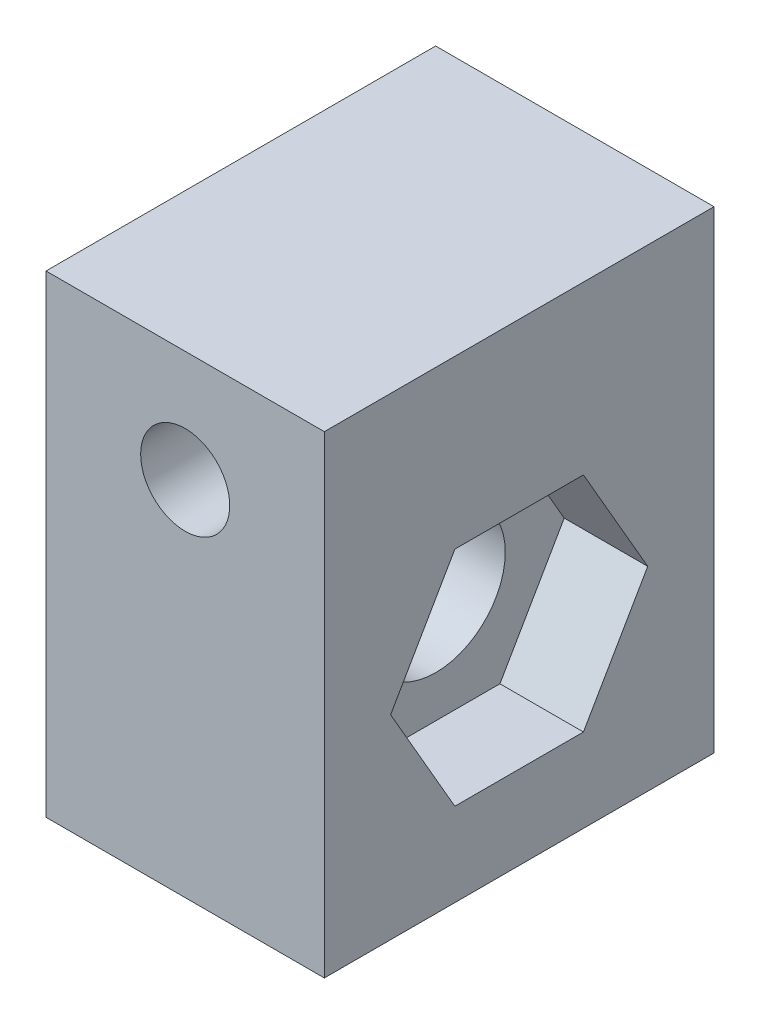
ISO-10303-21;
HEADER;
FILE_DESCRIPTION(('STEP AP214'),'2;1');
FILE_NAME('part.step','',(''),(''),'','','');
FILE_SCHEMA(('AUTOMOTIVE_DESIGN { 1 0 10303 214 1 1 1 1 }'));
ENDSEC;
DATA;
#1=APPLICATION_CONTEXT('core data for automotive mechanical design processes');
#2=APPLICATION_PROTOCOL_DEFINITION('international standard','automotive_design',2000,#1);
#3=PRODUCT_CONTEXT('',#1,'mechanical');
#4=PRODUCT('Part','Part','',(#3));
#5=PRODUCT_RELATED_PRODUCT_CATEGORY('part','',(#4));
#6=PRODUCT_DEFINITION_FORMATION('','',#4);
#7=PRODUCT_DEFINITION_CONTEXT('part definition',#1,'design');
#8=PRODUCT_DEFINITION('design','',#6,#7);
#9=PRODUCT_DEFINITION_SHAPE('','',#8);
#10=(LENGTH_UNIT() NAMED_UNIT(*) SI_UNIT(.MILLI.,.METRE.));
#11=(NAMED_UNIT(*) PLANE_ANGLE_UNIT() SI_UNIT($,.RADIAN.));
#12=(NAMED_UNIT(*) SI_UNIT($,.STERADIAN.) SOLID_ANGLE_UNIT());
#13=UNCERTAINTY_MEASURE_WITH_UNIT(LENGTH_MEASURE(1.E-05),#10,'distance_accuracy_value','');
#14=(GEOMETRIC_REPRESENTATION_CONTEXT(3) GLOBAL_UNCERTAINTY_ASSIGNED_CONTEXT((#13)) GLOBAL_UNIT_ASSIGNED_CONTEXT((#10,
#11,#12)) REPRESENTATION_CONTEXT('',''));
#15=CARTESIAN_POINT('',(0.,0.,0.));
#16=DIRECTION('',(0.,0.,1.));
#17=DIRECTION('',(1.,0.,0.));
#18=AXIS2_PLACEMENT_3D('',#15,#16,#17);
#19=CARTESIAN_POINT('',(5.,-8.5,14.));
#20=DIRECTION('',(-1.,0.,0.));
#21=DIRECTION('',(0.,0.,1.));
#22=AXIS2_PLACEMENT_3D('',#19,#20,#21);
#23=PLANE('',#22);
#24=DIRECTION('',(0.,1.,0.));
#25=VECTOR('',#24,1.);
#26=CARTESIAN_POINT('',(5.,-8.5,0.));
#27=LINE('',#26,#25);
#28=CARTESIAN_POINT('',(5.,-8.5,0.));
#29=VERTEX_POINT('',#28);
#30=CARTESIAN_POINT('',(5.,8.5,0.));
#31=VERTEX_POINT('',#30);
#32=EDGE_CURVE('E270',#29,#31,#27,.T.);
#33=ORIENTED_EDGE('',*,*,#32,.T.);
#34=DIRECTION('',(0.,0.,-1.));
#35=VECTOR('',#34,1.);
#36=CARTESIAN_POINT('',(5.,8.5,14.));
#37=LINE('',#36,#35);
#38=CARTESIAN_POINT('',(5.,8.5,14.));
#39=VERTEX_POINT('',#38);
#40=EDGE_CURVE('E275',#39,#31,#37,.T.);
#41=ORIENTED_EDGE('',*,*,#40,.F.);
#42=DIRECTION('',(0.,1.,0.));
#43=VECTOR('',#42,1.);
#44=CARTESIAN_POINT('',(5.,-8.5,14.));
#45=LINE('',#44,#43);
#46=CARTESIAN_POINT('',(5.,-8.5,14.));
#47=VERTEX_POINT('',#46);
#48=EDGE_CURVE('E261',#47,#39,#45,.T.);
#49=ORIENTED_EDGE('',*,*,#48,.F.);
#50=DIRECTION('',(0.,0.,-1.));
#51=VECTOR('',#50,1.);
#52=CARTESIAN_POINT('',(5.,-8.5,14.));
#53=LINE('',#52,#51);
#54=EDGE_CURVE('E40',#47,#29,#53,.T.);
#55=ORIENTED_EDGE('',*,*,#54,.T.);
#56=EDGE_LOOP('',(#33,#41,#49,#55));
#57=FACE_BOUND('',#56,.T.);
#58=DIRECTION('',(0.,-0.866025403784439,-0.5));
#59=VECTOR('',#58,1.);
#60=CARTESIAN_POINT('',(5.,2.5,4.69059892324149));
#61=LINE('',#60,#59);
#62=CARTESIAN_POINT('',(5.,2.5,4.69059892324149));
#63=VERTEX_POINT('',#62);
#64=CARTESIAN_POINT('',(5.,-1.50000000000001,2.38119784648299));
#65=VERTEX_POINT('',#64);
#66=EDGE_CURVE('E47',#63,#65,#61,.T.);
#67=ORIENTED_EDGE('',*,*,#66,.T.);
#68=DIRECTION('',(0.,-0.866025403784439,0.5));
#69=VECTOR('',#68,1.);
#70=CARTESIAN_POINT('',(5.,-1.50000000000001,2.38119784648299));
#71=LINE('',#70,#69);
#72=CARTESIAN_POINT('',(5.,-5.50000000000001,4.6905989232415));
#73=VERTEX_POINT('',#72);
#74=EDGE_CURVE('E167',#65,#73,#71,.T.);
#75=ORIENTED_EDGE('',*,*,#74,.T.);
#76=DIRECTION('',(0.,0.,1.));
#77=VECTOR('',#76,1.);
#78=CARTESIAN_POINT('',(5.,-5.50000000000001,4.6905989232415));
#79=LINE('',#78,#77);
#80=CARTESIAN_POINT('',(5.,-5.50000000000001,9.3094010767585));
#81=VERTEX_POINT('',#80);
#82=EDGE_CURVE('E170',#73,#81,#79,.T.);
#83=ORIENTED_EDGE('',*,*,#82,.T.);
#84=DIRECTION('',(0.,0.866025403784439,0.5));
#85=VECTOR('',#84,1.);
#86=CARTESIAN_POINT('',(5.,-5.50000000000001,9.3094010767585));
#87=LINE('',#86,#85);
#88=CARTESIAN_POINT('',(5.,-1.5,11.618802153517));
#89=VERTEX_POINT('',#88);
#90=EDGE_CURVE('E185',#81,#89,#87,.T.);
#91=ORIENTED_EDGE('',*,*,#90,.T.);
#92=DIRECTION('',(0.,0.866025403784438,-0.5));
#93=VECTOR('',#92,1.);
#94=CARTESIAN_POINT('',(5.,-1.5,11.618802153517));
#95=LINE('',#94,#93);
#96=CARTESIAN_POINT('',(5.,2.5,9.3094010767585));
#97=VERTEX_POINT('',#96);
#98=EDGE_CURVE('E182',#89,#97,#95,.T.);
#99=ORIENTED_EDGE('',*,*,#98,.T.);
#100=DIRECTION('',(0.,0.,-1.));
#101=VECTOR('',#100,1.);
#102=CARTESIAN_POINT('',(5.,2.5,9.3094010767585));
#103=LINE('',#102,#101);
#104=EDGE_CURVE('E180',#97,#63,#103,.T.);
#105=ORIENTED_EDGE('',*,*,#104,.T.);
#106=EDGE_LOOP('',(#67,#75,#83,#91,#99,#105));
#107=FACE_BOUND('',#106,.T.);
#108=ADVANCED_FACE('F31',(#57,#107),#23,.F.);
#109=CARTESIAN_POINT('',(5.,-1.5,7.));
#110=DIRECTION('',(-1.,0.,0.));
#111=DIRECTION('',(0.,0.,1.));
#112=AXIS2_PLACEMENT_3D('',#109,#110,#111);
#113=CYLINDRICAL_SURFACE('',#112,2.5);
#114=CARTESIAN_POINT('',(-2.,-1.5,7.));
#115=DIRECTION('',(-1.,0.,0.));
#116=DIRECTION('',(0.,0.,1.));
#117=AXIS2_PLACEMENT_3D('',#114,#115,#116);
#118=CIRCLE('',#117,2.5);
#119=CARTESIAN_POINT('',(-2.,-1.5,9.5));
#120=VERTEX_POINT('',#119);
#121=EDGE_CURVE('E199',#120,#120,#118,.T.);
#122=ORIENTED_EDGE('',*,*,#121,.T.);
#123=EDGE_LOOP('',(#122));
#124=FACE_BOUND('',#123,.T.);
#125=CARTESIAN_POINT('',(2.,-1.5,7.));
#126=DIRECTION('',(1.,0.,0.));
#127=DIRECTION('',(0.,0.,-1.));
#128=AXIS2_PLACEMENT_3D('',#125,#126,#127);
#129=CIRCLE('',#128,2.5);
#130=CARTESIAN_POINT('',(2.,-1.5,4.5));
#131=VERTEX_POINT('',#130);
#132=EDGE_CURVE('E35',#131,#131,#129,.F.);
#133=ORIENTED_EDGE('',*,*,#132,.F.);
#134=EDGE_LOOP('',(#133));
#135=FACE_BOUND('',#134,.T.);
#136=ADVANCED_FACE('F306',(#124,#135),#113,.F.);
#137=CARTESIAN_POINT('',(-5.,-8.5,14.));
#138=DIRECTION('',(1.,0.,0.));
#139=DIRECTION('',(0.,0.,-1.));
#140=AXIS2_PLACEMENT_3D('',#137,#138,#139);
#141=PLANE('',#140);
#142=DIRECTION('',(0.,-0.866025403784439,0.5));
#143=VECTOR('',#142,1.);
#144=CARTESIAN_POINT('',(-5.,-1.50000000000001,2.38119784648299));
#145=LINE('',#144,#143);
#146=CARTESIAN_POINT('',(-5.,-1.5,2.38119784648299));
#147=VERTEX_POINT('',#146);
#148=CARTESIAN_POINT('',(-5.,-5.50000000000001,4.6905989232415));
#149=VERTEX_POINT('',#148);
#150=EDGE_CURVE('E223',#147,#149,#145,.T.);
#151=ORIENTED_EDGE('',*,*,#150,.F.);
#152=DIRECTION('',(0.,-0.866025403784439,-0.5));
#153=VECTOR('',#152,1.);
#154=CARTESIAN_POINT('',(-5.,2.5,4.69059892324149));
#155=LINE('',#154,#153);
#156=CARTESIAN_POINT('',(-5.,2.5,4.69059892324149));
#157=VERTEX_POINT('',#156);
#158=EDGE_CURVE('E55',#157,#147,#155,.T.);
#159=ORIENTED_EDGE('',*,*,#158,.F.);
#160=DIRECTION('',(0.,0.,-1.));
#161=VECTOR('',#160,1.);
#162=CARTESIAN_POINT('',(-5.,2.5,9.3094010767585));
#163=LINE('',#162,#161);
#164=CARTESIAN_POINT('',(-5.,2.5,9.3094010767585));
#165=VERTEX_POINT('',#164);
#166=EDGE_CURVE('E206',#165,#157,#163,.T.);
#167=ORIENTED_EDGE('',*,*,#166,.F.);
#168=DIRECTION('',(0.,0.866025403784438,-0.5));
#169=VECTOR('',#168,1.);
#170=CARTESIAN_POINT('',(-5.,-1.5,11.618802153517));
#171=LINE('',#170,#169);
#172=CARTESIAN_POINT('',(-5.,-1.5,11.618802153517));
#173=VERTEX_POINT('',#172);
#174=EDGE_CURVE('E232',#173,#165,#171,.T.);
#175=ORIENTED_EDGE('',*,*,#174,.F.);
#176=DIRECTION('',(0.,0.866025403784439,0.5));
#177=VECTOR('',#176,1.);
#178=CARTESIAN_POINT('',(-5.,-5.50000000000001,9.3094010767585));
#179=LINE('',#178,#177);
#180=CARTESIAN_POINT('',(-5.,-5.50000000000001,9.3094010767585));
#181=VERTEX_POINT('',#180);
#182=EDGE_CURVE('E229',#181,#173,#179,.T.);
#183=ORIENTED_EDGE('',*,*,#182,.F.);
#184=DIRECTION('',(0.,0.,1.));
#185=VECTOR('',#184,1.);
#186=CARTESIAN_POINT('',(-5.,-5.50000000000001,4.6905989232415));
#187=LINE('',#186,#185);
#188=EDGE_CURVE('E226',#149,#181,#187,.T.);
#189=ORIENTED_EDGE('',*,*,#188,.F.);
#190=EDGE_LOOP('',(#151,#159,#167,#175,#183,#189));
#191=FACE_BOUND('',#190,.T.);
#192=DIRECTION('',(0.,-1.,0.));
#193=VECTOR('',#192,1.);
#194=CARTESIAN_POINT('',(-5.,-8.5,0.));
#195=LINE('',#194,#193);
#196=CARTESIAN_POINT('',(-5.,8.5,0.));
#197=VERTEX_POINT('',#196);
#198=CARTESIAN_POINT('',(-5.,-8.5,0.));
#199=VERTEX_POINT('',#198);
#200=EDGE_CURVE('E252',#197,#199,#195,.T.);
#201=ORIENTED_EDGE('',*,*,#200,.T.);
#202=DIRECTION('',(0.,0.,-1.));
#203=VECTOR('',#202,1.);
#204=CARTESIAN_POINT('',(-5.,-8.5,14.));
#205=LINE('',#204,#203);
#206=CARTESIAN_POINT('',(-5.,-8.5,14.));
#207=VERTEX_POINT('',#206);
#208=EDGE_CURVE('E11',#207,#199,#205,.T.);
#209=ORIENTED_EDGE('',*,*,#208,.F.);
#210=DIRECTION('',(0.,-1.,0.));
#211=VECTOR('',#210,1.);
#212=CARTESIAN_POINT('',(-5.,-8.5,14.));
#213=LINE('',#212,#211);
#214=CARTESIAN_POINT('',(-5.,8.5,14.));
#215=VERTEX_POINT('',#214);
#216=EDGE_CURVE('E255',#215,#207,#213,.T.);
#217=ORIENTED_EDGE('',*,*,#216,.F.);
#218=DIRECTION('',(0.,0.,-1.));
#219=VECTOR('',#218,1.);
#220=CARTESIAN_POINT('',(-5.,8.5,14.));
#221=LINE('',#220,#219);
#222=EDGE_CURVE('E265',#215,#197,#221,.T.);
#223=ORIENTED_EDGE('',*,*,#222,.T.);
#224=EDGE_LOOP('',(#201,#209,#217,#223));
#225=FACE_BOUND('',#224,.T.);
#226=ADVANCED_FACE('F33',(#191,#225),#141,.F.);
#227=CARTESIAN_POINT('',(5.,-8.5,14.));
#228=DIRECTION('',(0.,1.,0.));
#229=DIRECTION('',(-1.,0.,0.));
#230=AXIS2_PLACEMENT_3D('',#227,#228,#229);
#231=PLANE('',#230);
#232=DIRECTION('',(1.,0.,0.));
#233=VECTOR('',#232,1.);
#234=CARTESIAN_POINT('',(5.,-8.5,0.));
#235=LINE('',#234,#233);
#236=EDGE_CURVE('E268',#199,#29,#235,.T.);
#237=ORIENTED_EDGE('',*,*,#236,.T.);
#238=ORIENTED_EDGE('',*,*,#54,.F.);
#239=DIRECTION('',(1.,0.,0.));
#240=VECTOR('',#239,1.);
#241=CARTESIAN_POINT('',(5.,-8.5,14.));
#242=LINE('',#241,#240);
#243=EDGE_CURVE('E258',#207,#47,#242,.T.);
#244=ORIENTED_EDGE('',*,*,#243,.F.);
#245=ORIENTED_EDGE('',*,*,#208,.T.);
#246=EDGE_LOOP('',(#237,#238,#244,#245));
#247=FACE_BOUND('',#246,.T.);
#248=ADVANCED_FACE('F299',(#247),#231,.F.);
#249=CARTESIAN_POINT('',(5.,8.5,14.));
#250=DIRECTION('',(0.,-1.,0.));
#251=DIRECTION('',(1.,0.,0.));
#252=AXIS2_PLACEMENT_3D('',#249,#250,#251);
#253=PLANE('',#252);
#254=DIRECTION('',(-1.,0.,0.));
#255=VECTOR('',#254,1.);
#256=CARTESIAN_POINT('',(5.,8.5,0.));
#257=LINE('',#256,#255);
#258=EDGE_CURVE('E259',#31,#197,#257,.T.);
#259=ORIENTED_EDGE('',*,*,#258,.T.);
#260=ORIENTED_EDGE('',*,*,#222,.F.);
#261=DIRECTION('',(-1.,0.,0.));
#262=VECTOR('',#261,1.);
#263=CARTESIAN_POINT('',(5.,8.5,14.));
#264=LINE('',#263,#262);
#265=EDGE_CURVE('E263',#39,#215,#264,.T.);
#266=ORIENTED_EDGE('',*,*,#265,.F.);
#267=ORIENTED_EDGE('',*,*,#40,.T.);
#268=EDGE_LOOP('',(#259,#260,#266,#267));
#269=FACE_BOUND('',#268,.T.);
#270=ADVANCED_FACE('F292',(#269),#253,.F.);
#271=CARTESIAN_POINT('',(-5.,8.5,14.));
#272=DIRECTION('',(0.,0.,1.));
#273=DIRECTION('',(1.,0.,0.));
#274=AXIS2_PLACEMENT_3D('',#271,#272,#273);
#275=PLANE('',#274);
#276=CARTESIAN_POINT('',(0.,4.5,14.));
#277=DIRECTION('',(0.,0.,-1.));
#278=DIRECTION('',(-1.,0.,0.));
#279=AXIS2_PLACEMENT_3D('',#276,#277,#278);
#280=CIRCLE('',#279,1.6);
#281=CARTESIAN_POINT('',(-1.6,4.5,14.));
#282=VERTEX_POINT('',#281);
#283=EDGE_CURVE('E249',#282,#282,#280,.T.);
#284=ORIENTED_EDGE('',*,*,#283,.T.);
#285=EDGE_LOOP('',(#284));
#286=FACE_BOUND('',#285,.T.);
#287=ORIENTED_EDGE('',*,*,#216,.T.);
#288=ORIENTED_EDGE('',*,*,#243,.T.);
#289=ORIENTED_EDGE('',*,*,#48,.T.);
#290=ORIENTED_EDGE('',*,*,#265,.T.);
#291=EDGE_LOOP('',(#287,#288,#289,#290));
#292=FACE_BOUND('',#291,.T.);
#293=ADVANCED_FACE('F298',(#286,#292),#275,.T.);
#294=CARTESIAN_POINT('',(-5.,8.5,0.));
#295=DIRECTION('',(0.,0.,1.));
#296=DIRECTION('',(1.,0.,0.));
#297=AXIS2_PLACEMENT_3D('',#294,#295,#296);
#298=PLANE('',#297);
#299=CARTESIAN_POINT('',(0.,4.5,0.));
#300=DIRECTION('',(0.,0.,-1.));
#301=DIRECTION('',(-1.,0.,0.));
#302=AXIS2_PLACEMENT_3D('',#299,#300,#301);
#303=CIRCLE('',#302,1.6);
#304=CARTESIAN_POINT('',(-1.6,4.5,0.));
#305=VERTEX_POINT('',#304);
#306=EDGE_CURVE('E239',#305,#305,#303,.T.);
#307=ORIENTED_EDGE('',*,*,#306,.F.);
#308=EDGE_LOOP('',(#307));
#309=FACE_BOUND('',#308,.T.);
#310=ORIENTED_EDGE('',*,*,#200,.F.);
#311=ORIENTED_EDGE('',*,*,#258,.F.);
#312=ORIENTED_EDGE('',*,*,#32,.F.);
#313=ORIENTED_EDGE('',*,*,#236,.F.);
#314=EDGE_LOOP('',(#310,#311,#312,#313));
#315=FACE_BOUND('',#314,.T.);
#316=ADVANCED_FACE('F289',(#309,#315),#298,.F.);
#317=CARTESIAN_POINT('',(0.,4.5,14.));
#318=DIRECTION('',(0.,0.,-1.));
#319=DIRECTION('',(-1.,0.,0.));
#320=AXIS2_PLACEMENT_3D('',#317,#318,#319);
#321=CYLINDRICAL_SURFACE('',#320,1.6);
#322=ORIENTED_EDGE('',*,*,#283,.F.);
#323=EDGE_LOOP('',(#322));
#324=FACE_BOUND('',#323,.T.);
#325=ORIENTED_EDGE('',*,*,#306,.T.);
#326=EDGE_LOOP('',(#325));
#327=FACE_BOUND('',#326,.T.);
#328=ADVANCED_FACE('F318',(#324,#327),#321,.F.);
#329=CARTESIAN_POINT('',(-2.,2.5,4.69059892324149));
#330=DIRECTION('',(0.,0.5,-0.866025403784439));
#331=DIRECTION('',(0.,0.866025403784439,0.5));
#332=AXIS2_PLACEMENT_3D('',#329,#330,#331);
#333=PLANE('',#332);
#334=ORIENTED_EDGE('',*,*,#158,.T.);
#335=DIRECTION('',(-1.,0.,0.));
#336=VECTOR('',#335,1.);
#337=CARTESIAN_POINT('',(-2.,-1.50000000000001,2.38119784648299));
#338=LINE('',#337,#336);
#339=CARTESIAN_POINT('',(-2.,-1.50000000000001,2.38119784648299));
#340=VERTEX_POINT('',#339);
#341=EDGE_CURVE('E221',#340,#147,#338,.T.);
#342=ORIENTED_EDGE('',*,*,#341,.F.);
#343=DIRECTION('',(0.,-0.866025403784439,-0.5));
#344=VECTOR('',#343,1.);
#345=CARTESIAN_POINT('',(-2.,2.5,4.69059892324149));
#346=LINE('',#345,#344);
#347=CARTESIAN_POINT('',(-2.,2.5,4.69059892324149));
#348=VERTEX_POINT('',#347);
#349=EDGE_CURVE('E202',#348,#340,#346,.T.);
#350=ORIENTED_EDGE('',*,*,#349,.F.);
#351=DIRECTION('',(-1.,0.,0.));
#352=VECTOR('',#351,1.);
#353=CARTESIAN_POINT('',(-2.,2.5,4.69059892324149));
#354=LINE('',#353,#352);
#355=EDGE_CURVE('E237',#348,#157,#354,.T.);
#356=ORIENTED_EDGE('',*,*,#355,.T.);
#357=EDGE_LOOP('',(#334,#342,#350,#356));
#358=FACE_BOUND('',#357,.T.);
#359=ADVANCED_FACE('F325',(#358),#333,.F.);
#360=CARTESIAN_POINT('',(-2.,2.5,9.3094010767585));
#361=DIRECTION('',(0.,1.,0.));
#362=DIRECTION('',(0.,0.,1.));
#363=AXIS2_PLACEMENT_3D('',#360,#361,#362);
#364=PLANE('',#363);
#365=ORIENTED_EDGE('',*,*,#166,.T.);
#366=ORIENTED_EDGE('',*,*,#355,.F.);
#367=DIRECTION('',(0.,0.,-1.));
#368=VECTOR('',#367,1.);
#369=CARTESIAN_POINT('',(-2.,2.5,9.3094010767585));
#370=LINE('',#369,#368);
#371=CARTESIAN_POINT('',(-2.,2.5,9.3094010767585));
#372=VERTEX_POINT('',#371);
#373=EDGE_CURVE('E218',#372,#348,#370,.T.);
#374=ORIENTED_EDGE('',*,*,#373,.F.);
#375=DIRECTION('',(-1.,0.,0.));
#376=VECTOR('',#375,1.);
#377=CARTESIAN_POINT('',(-2.,2.5,9.3094010767585));
#378=LINE('',#377,#376);
#379=EDGE_CURVE('E240',#372,#165,#378,.T.);
#380=ORIENTED_EDGE('',*,*,#379,.T.);
#381=EDGE_LOOP('',(#365,#366,#374,#380));
#382=FACE_BOUND('',#381,.T.);
#383=ADVANCED_FACE('F329',(#382),#364,.F.);
#384=CARTESIAN_POINT('',(-2.,-1.5,11.618802153517));
#385=DIRECTION('',(0.,0.5,0.866025403784439));
#386=DIRECTION('',(0.,-0.866025403784439,0.5));
#387=AXIS2_PLACEMENT_3D('',#384,#385,#386);
#388=PLANE('',#387);
#389=ORIENTED_EDGE('',*,*,#174,.T.);
#390=ORIENTED_EDGE('',*,*,#379,.F.);
#391=DIRECTION('',(0.,0.866025403784438,-0.5));
#392=VECTOR('',#391,1.);
#393=CARTESIAN_POINT('',(-2.,-1.5,11.618802153517));
#394=LINE('',#393,#392);
#395=CARTESIAN_POINT('',(-2.,-1.5,11.618802153517));
#396=VERTEX_POINT('',#395);
#397=EDGE_CURVE('E215',#396,#372,#394,.T.);
#398=ORIENTED_EDGE('',*,*,#397,.F.);
#399=DIRECTION('',(-1.,0.,0.));
#400=VECTOR('',#399,1.);
#401=CARTESIAN_POINT('',(-2.,-1.5,11.618802153517));
#402=LINE('',#401,#400);
#403=EDGE_CURVE('E242',#396,#173,#402,.T.);
#404=ORIENTED_EDGE('',*,*,#403,.T.);
#405=EDGE_LOOP('',(#389,#390,#398,#404));
#406=FACE_BOUND('',#405,.T.);
#407=ADVANCED_FACE('F342',(#406),#388,.F.);
#408=CARTESIAN_POINT('',(-2.,-5.50000000000001,9.3094010767585));
#409=DIRECTION('',(0.,-0.5,0.866025403784439));
#410=DIRECTION('',(0.,-0.866025403784439,-0.5));
#411=AXIS2_PLACEMENT_3D('',#408,#409,#410);
#412=PLANE('',#411);
#413=ORIENTED_EDGE('',*,*,#182,.T.);
#414=ORIENTED_EDGE('',*,*,#403,.F.);
#415=DIRECTION('',(0.,0.866025403784439,0.5));
#416=VECTOR('',#415,1.);
#417=CARTESIAN_POINT('',(-2.,-5.50000000000001,9.3094010767585));
#418=LINE('',#417,#416);
#419=CARTESIAN_POINT('',(-2.,-5.50000000000001,9.3094010767585));
#420=VERTEX_POINT('',#419);
#421=EDGE_CURVE('E212',#420,#396,#418,.T.);
#422=ORIENTED_EDGE('',*,*,#421,.F.);
#423=DIRECTION('',(-1.,0.,0.));
#424=VECTOR('',#423,1.);
#425=CARTESIAN_POINT('',(-2.,-5.50000000000001,9.3094010767585));
#426=LINE('',#425,#424);
#427=EDGE_CURVE('E244',#420,#181,#426,.T.);
#428=ORIENTED_EDGE('',*,*,#427,.T.);
#429=EDGE_LOOP('',(#413,#414,#422,#428));
#430=FACE_BOUND('',#429,.T.);
#431=ADVANCED_FACE('F338',(#430),#412,.F.);
#432=CARTESIAN_POINT('',(-2.,-5.50000000000001,4.6905989232415));
#433=DIRECTION('',(0.,-1.,0.));
#434=DIRECTION('',(0.,0.,-1.));
#435=AXIS2_PLACEMENT_3D('',#432,#433,#434);
#436=PLANE('',#435);
#437=ORIENTED_EDGE('',*,*,#188,.T.);
#438=ORIENTED_EDGE('',*,*,#427,.F.);
#439=DIRECTION('',(0.,0.,1.));
#440=VECTOR('',#439,1.);
#441=CARTESIAN_POINT('',(-2.,-5.50000000000001,4.6905989232415));
#442=LINE('',#441,#440);
#443=CARTESIAN_POINT('',(-2.,-5.50000000000001,4.6905989232415));
#444=VERTEX_POINT('',#443);
#445=EDGE_CURVE('E209',#444,#420,#442,.T.);
#446=ORIENTED_EDGE('',*,*,#445,.F.);
#447=DIRECTION('',(-1.,0.,0.));
#448=VECTOR('',#447,1.);
#449=CARTESIAN_POINT('',(-2.,-5.50000000000001,4.6905989232415));
#450=LINE('',#449,#448);
#451=EDGE_CURVE('E246',#444,#149,#450,.T.);
#452=ORIENTED_EDGE('',*,*,#451,.T.);
#453=EDGE_LOOP('',(#437,#438,#446,#452));
#454=FACE_BOUND('',#453,.T.);
#455=ADVANCED_FACE('F334',(#454),#436,.F.);
#456=CARTESIAN_POINT('',(-2.,-1.50000000000001,2.38119784648299));
#457=DIRECTION('',(0.,-0.5,-0.866025403784439));
#458=DIRECTION('',(0.,0.866025403784439,-0.5));
#459=AXIS2_PLACEMENT_3D('',#456,#457,#458);
#460=PLANE('',#459);
#461=ORIENTED_EDGE('',*,*,#150,.T.);
#462=ORIENTED_EDGE('',*,*,#451,.F.);
#463=DIRECTION('',(0.,-0.866025403784439,0.5));
#464=VECTOR('',#463,1.);
#465=CARTESIAN_POINT('',(-2.,-1.50000000000001,2.38119784648299));
#466=LINE('',#465,#464);
#467=EDGE_CURVE('E205',#340,#444,#466,.T.);
#468=ORIENTED_EDGE('',*,*,#467,.F.);
#469=ORIENTED_EDGE('',*,*,#341,.T.);
#470=EDGE_LOOP('',(#461,#462,#468,#469));
#471=FACE_BOUND('',#470,.T.);
#472=ADVANCED_FACE('F330',(#471),#460,.F.);
#473=CARTESIAN_POINT('',(-2.,-1.50000000000001,2.38119784648299));
#474=DIRECTION('',(-1.,0.,0.));
#475=DIRECTION('',(0.,0.,1.));
#476=AXIS2_PLACEMENT_3D('',#473,#474,#475);
#477=PLANE('',#476);
#478=ORIENTED_EDGE('',*,*,#121,.F.);
#479=EDGE_LOOP('',(#478));
#480=FACE_BOUND('',#479,.T.);
#481=ORIENTED_EDGE('',*,*,#349,.T.);
#482=ORIENTED_EDGE('',*,*,#467,.T.);
#483=ORIENTED_EDGE('',*,*,#445,.T.);
#484=ORIENTED_EDGE('',*,*,#421,.T.);
#485=ORIENTED_EDGE('',*,*,#397,.T.);
#486=ORIENTED_EDGE('',*,*,#373,.T.);
#487=EDGE_LOOP('',(#481,#482,#483,#484,#485,#486));
#488=FACE_BOUND('',#487,.T.);
#489=ADVANCED_FACE('F333',(#480,#488),#477,.T.);
#490=CARTESIAN_POINT('',(2.,-1.50000000000001,2.38119784648299));
#491=DIRECTION('',(1.,0.,0.));
#492=DIRECTION('',(0.,0.,1.));
#493=AXIS2_PLACEMENT_3D('',#490,#491,#492);
#494=PLANE('',#493);
#495=DIRECTION('',(0.,-0.866025403784439,-0.5));
#496=VECTOR('',#495,1.);
#497=CARTESIAN_POINT('',(2.,2.5,4.69059892324149));
#498=LINE('',#497,#496);
#499=CARTESIAN_POINT('',(2.,2.5,4.69059892324149));
#500=VERTEX_POINT('',#499);
#501=CARTESIAN_POINT('',(2.,-1.50000000000001,2.38119784648299));
#502=VERTEX_POINT('',#501);
#503=EDGE_CURVE('E157',#500,#502,#498,.T.);
#504=ORIENTED_EDGE('',*,*,#503,.F.);
#505=DIRECTION('',(0.,0.,-1.));
#506=VECTOR('',#505,1.);
#507=CARTESIAN_POINT('',(2.,2.5,9.3094010767585));
#508=LINE('',#507,#506);
#509=CARTESIAN_POINT('',(2.,2.5,9.3094010767585));
#510=VERTEX_POINT('',#509);
#511=EDGE_CURVE('E147',#510,#500,#508,.T.);
#512=ORIENTED_EDGE('',*,*,#511,.F.);
#513=DIRECTION('',(0.,0.866025403784438,-0.5));
#514=VECTOR('',#513,1.);
#515=CARTESIAN_POINT('',(2.,-1.5,11.618802153517));
#516=LINE('',#515,#514);
#517=CARTESIAN_POINT('',(2.,-1.5,11.618802153517));
#518=VERTEX_POINT('',#517);
#519=EDGE_CURVE('E156',#518,#510,#516,.T.);
#520=ORIENTED_EDGE('',*,*,#519,.F.);
#521=DIRECTION('',(0.,0.866025403784439,0.5));
#522=VECTOR('',#521,1.);
#523=CARTESIAN_POINT('',(2.,-5.50000000000001,9.3094010767585));
#524=LINE('',#523,#522);
#525=CARTESIAN_POINT('',(2.,-5.50000000000001,9.3094010767585));
#526=VERTEX_POINT('',#525);
#527=EDGE_CURVE('E174',#526,#518,#524,.T.);
#528=ORIENTED_EDGE('',*,*,#527,.F.);
#529=DIRECTION('',(0.,0.,1.));
#530=VECTOR('',#529,1.);
#531=CARTESIAN_POINT('',(2.,-5.50000000000001,4.6905989232415));
#532=LINE('',#531,#530);
#533=CARTESIAN_POINT('',(2.,-5.50000000000001,4.6905989232415));
#534=VERTEX_POINT('',#533);
#535=EDGE_CURVE('E176',#534,#526,#532,.T.);
#536=ORIENTED_EDGE('',*,*,#535,.F.);
#537=DIRECTION('',(0.,-0.866025403784439,0.5));
#538=VECTOR('',#537,1.);
#539=CARTESIAN_POINT('',(2.,-1.50000000000001,2.38119784648299));
#540=LINE('',#539,#538);
#541=EDGE_CURVE('E162',#502,#534,#540,.T.);
#542=ORIENTED_EDGE('',*,*,#541,.F.);
#543=EDGE_LOOP('',(#504,#512,#520,#528,#536,#542));
#544=FACE_BOUND('',#543,.T.);
#545=ORIENTED_EDGE('',*,*,#132,.T.);
#546=EDGE_LOOP('',(#545));
#547=FACE_BOUND('',#546,.T.);
#548=ADVANCED_FACE('F164',(#544,#547),#494,.T.);
#549=CARTESIAN_POINT('',(2.,2.5,4.69059892324149));
#550=DIRECTION('',(0.,-0.5,0.866025403784439));
#551=DIRECTION('',(0.,-0.866025403784439,-0.5));
#552=AXIS2_PLACEMENT_3D('',#549,#550,#551);
#553=PLANE('',#552);
#554=ORIENTED_EDGE('',*,*,#66,.F.);
#555=DIRECTION('',(1.,0.,0.));
#556=VECTOR('',#555,1.);
#557=CARTESIAN_POINT('',(2.,2.5,4.69059892324149));
#558=LINE('',#557,#556);
#559=EDGE_CURVE('E150',#500,#63,#558,.T.);
#560=ORIENTED_EDGE('',*,*,#559,.F.);
#561=ORIENTED_EDGE('',*,*,#503,.T.);
#562=DIRECTION('',(1.,0.,0.));
#563=VECTOR('',#562,1.);
#564=CARTESIAN_POINT('',(2.,-1.50000000000001,2.38119784648299));
#565=LINE('',#564,#563);
#566=EDGE_CURVE('E190',#502,#65,#565,.T.);
#567=ORIENTED_EDGE('',*,*,#566,.T.);
#568=EDGE_LOOP('',(#554,#560,#561,#567));
#569=FACE_BOUND('',#568,.T.);
#570=ADVANCED_FACE('F160',(#569),#553,.T.);
#571=CARTESIAN_POINT('',(2.,-1.50000000000001,2.38119784648299));
#572=DIRECTION('',(0.,0.5,0.866025403784439));
#573=DIRECTION('',(0.,-0.866025403784439,0.5));
#574=AXIS2_PLACEMENT_3D('',#571,#572,#573);
#575=PLANE('',#574);
#576=ORIENTED_EDGE('',*,*,#74,.F.);
#577=ORIENTED_EDGE('',*,*,#566,.F.);
#578=ORIENTED_EDGE('',*,*,#541,.T.);
#579=DIRECTION('',(1.,0.,0.));
#580=VECTOR('',#579,1.);
#581=CARTESIAN_POINT('',(2.,-5.50000000000001,4.6905989232415));
#582=LINE('',#581,#580);
#583=EDGE_CURVE('E192',#534,#73,#582,.T.);
#584=ORIENTED_EDGE('',*,*,#583,.T.);
#585=EDGE_LOOP('',(#576,#577,#578,#584));
#586=FACE_BOUND('',#585,.T.);
#587=ADVANCED_FACE('F355',(#586),#575,.T.);
#588=CARTESIAN_POINT('',(2.,-5.50000000000001,4.6905989232415));
#589=DIRECTION('',(0.,1.,0.));
#590=DIRECTION('',(0.,0.,1.));
#591=AXIS2_PLACEMENT_3D('',#588,#589,#590);
#592=PLANE('',#591);
#593=ORIENTED_EDGE('',*,*,#82,.F.);
#594=ORIENTED_EDGE('',*,*,#583,.F.);
#595=ORIENTED_EDGE('',*,*,#535,.T.);
#596=DIRECTION('',(1.,0.,0.));
#597=VECTOR('',#596,1.);
#598=CARTESIAN_POINT('',(2.,-5.50000000000001,9.3094010767585));
#599=LINE('',#598,#597);
#600=EDGE_CURVE('E194',#526,#81,#599,.T.);
#601=ORIENTED_EDGE('',*,*,#600,.T.);
#602=EDGE_LOOP('',(#593,#594,#595,#601));
#603=FACE_BOUND('',#602,.T.);
#604=ADVANCED_FACE('F365',(#603),#592,.T.);
#605=CARTESIAN_POINT('',(2.,-5.50000000000001,9.3094010767585));
#606=DIRECTION('',(0.,0.5,-0.866025403784439));
#607=DIRECTION('',(0.,0.866025403784439,0.5));
#608=AXIS2_PLACEMENT_3D('',#605,#606,#607);
#609=PLANE('',#608);
#610=ORIENTED_EDGE('',*,*,#90,.F.);
#611=ORIENTED_EDGE('',*,*,#600,.F.);
#612=ORIENTED_EDGE('',*,*,#527,.T.);
#613=DIRECTION('',(1.,0.,0.));
#614=VECTOR('',#613,1.);
#615=CARTESIAN_POINT('',(2.,-1.5,11.618802153517));
#616=LINE('',#615,#614);
#617=EDGE_CURVE('E196',#518,#89,#616,.T.);
#618=ORIENTED_EDGE('',*,*,#617,.T.);
#619=EDGE_LOOP('',(#610,#611,#612,#618));
#620=FACE_BOUND('',#619,.T.);
#621=ADVANCED_FACE('F361',(#620),#609,.T.);
#622=CARTESIAN_POINT('',(2.,-1.5,11.618802153517));
#623=DIRECTION('',(0.,-0.5,-0.866025403784439));
#624=DIRECTION('',(0.,0.866025403784439,-0.5));
#625=AXIS2_PLACEMENT_3D('',#622,#623,#624);
#626=PLANE('',#625);
#627=ORIENTED_EDGE('',*,*,#98,.F.);
#628=ORIENTED_EDGE('',*,*,#617,.F.);
#629=ORIENTED_EDGE('',*,*,#519,.T.);
#630=DIRECTION('',(1.,0.,0.));
#631=VECTOR('',#630,1.);
#632=CARTESIAN_POINT('',(2.,2.5,9.3094010767585));
#633=LINE('',#632,#631);
#634=EDGE_CURVE('E152',#510,#97,#633,.T.);
#635=ORIENTED_EDGE('',*,*,#634,.T.);
#636=EDGE_LOOP('',(#627,#628,#629,#635));
#637=FACE_BOUND('',#636,.T.);
#638=ADVANCED_FACE('F358',(#637),#626,.T.);
#639=CARTESIAN_POINT('',(2.,2.5,9.3094010767585));
#640=DIRECTION('',(0.,-1.,0.));
#641=DIRECTION('',(0.,0.,-1.));
#642=AXIS2_PLACEMENT_3D('',#639,#640,#641);
#643=PLANE('',#642);
#644=ORIENTED_EDGE('',*,*,#104,.F.);
#645=ORIENTED_EDGE('',*,*,#634,.F.);
#646=ORIENTED_EDGE('',*,*,#511,.T.);
#647=ORIENTED_EDGE('',*,*,#559,.T.);
#648=EDGE_LOOP('',(#644,#645,#646,#647));
#649=FACE_BOUND('',#648,.T.);
#650=ADVANCED_FACE('F149',(#649),#643,.T.);
#651=CLOSED_SHELL('',(#108,#136,#226,#248,#270,#293,#316,#328,#359,#383,#407,#431,#455,#472,
#489,#548,#570,#587,#604,#621,#638,#650));
#652=MANIFOLD_SOLID_BREP('B2',#651);
#653=ADVANCED_BREP_SHAPE_REPRESENTATION('',(#18,#652),#14);
#654=SHAPE_DEFINITION_REPRESENTATION(#9,#653);
ENDSEC;
END-ISO-10303-21;
